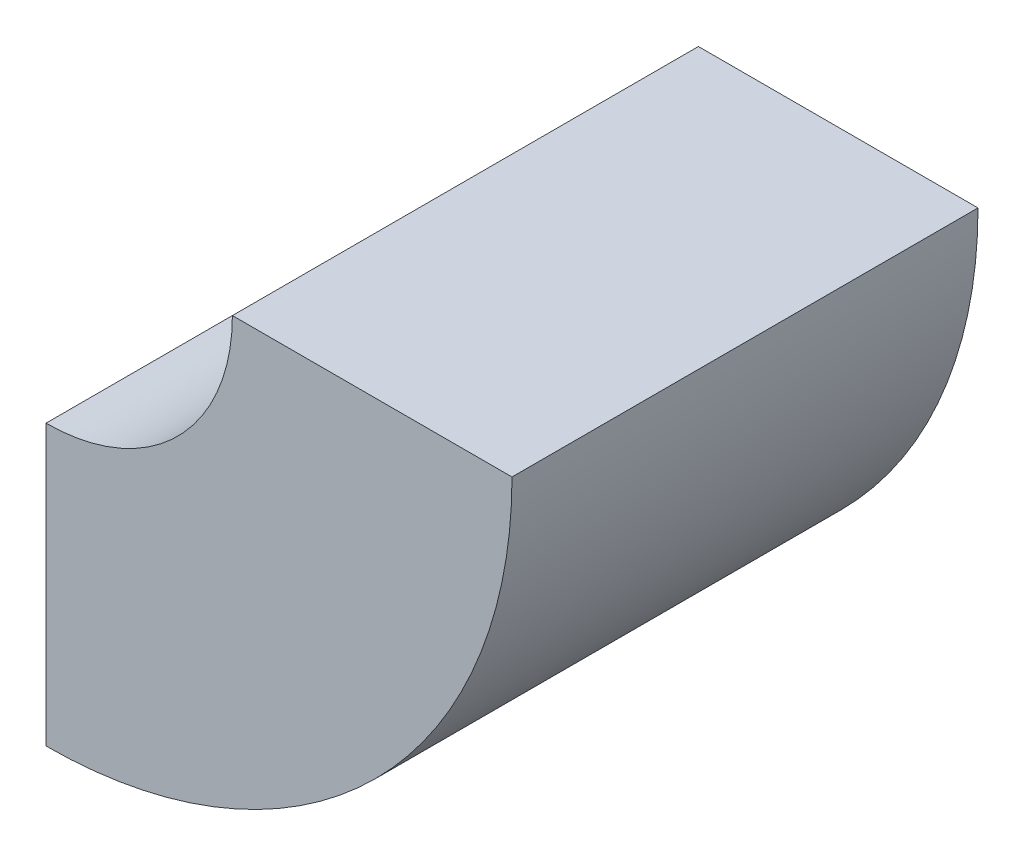
ISO-10303-21;
HEADER;
FILE_DESCRIPTION(('STEP AP214'),'2;1');
FILE_NAME('part.step','',(''),(''),'','','');
FILE_SCHEMA(('AUTOMOTIVE_DESIGN { 1 0 10303 214 1 1 1 1 }'));
ENDSEC;
DATA;
#1=APPLICATION_CONTEXT('core data for automotive mechanical design processes');
#2=APPLICATION_PROTOCOL_DEFINITION('international standard','automotive_design',2000,#1);
#3=PRODUCT_CONTEXT('',#1,'mechanical');
#4=PRODUCT('Part','Part','',(#3));
#5=PRODUCT_RELATED_PRODUCT_CATEGORY('part','',(#4));
#6=PRODUCT_DEFINITION_FORMATION('','',#4);
#7=PRODUCT_DEFINITION_CONTEXT('part definition',#1,'design');
#8=PRODUCT_DEFINITION('design','',#6,#7);
#9=PRODUCT_DEFINITION_SHAPE('','',#8);
#10=(LENGTH_UNIT() NAMED_UNIT(*) SI_UNIT(.MILLI.,.METRE.));
#11=(NAMED_UNIT(*) PLANE_ANGLE_UNIT() SI_UNIT($,.RADIAN.));
#12=(NAMED_UNIT(*) SI_UNIT($,.STERADIAN.) SOLID_ANGLE_UNIT());
#13=UNCERTAINTY_MEASURE_WITH_UNIT(LENGTH_MEASURE(1.E-05),#10,'distance_accuracy_value','');
#14=(GEOMETRIC_REPRESENTATION_CONTEXT(3) GLOBAL_UNCERTAINTY_ASSIGNED_CONTEXT((#13)) GLOBAL_UNIT_ASSIGNED_CONTEXT((#10,
#11,#12)) REPRESENTATION_CONTEXT('',''));
#15=CARTESIAN_POINT('',(0.,0.,0.));
#16=DIRECTION('',(0.,0.,1.));
#17=DIRECTION('',(1.,0.,0.));
#18=AXIS2_PLACEMENT_3D('',#15,#16,#17);
#19=CARTESIAN_POINT('',(-25.,0.,25.));
#20=DIRECTION('',(0.,0.,-1.));
#21=DIRECTION('',(-1.,0.,0.));
#22=AXIS2_PLACEMENT_3D('',#19,#20,#21);
#23=CYLINDRICAL_SURFACE('',#22,10.);
#24=CARTESIAN_POINT('',(-25.,0.,0.));
#25=DIRECTION('',(0.,0.,-1.));
#26=DIRECTION('',(1.,0.,0.));
#27=AXIS2_PLACEMENT_3D('',#24,#25,#26);
#28=CIRCLE('',#27,10.);
#29=CARTESIAN_POINT('',(-15.,0.,0.));
#30=VERTEX_POINT('',#29);
#31=CARTESIAN_POINT('',(-25.,-9.99999999999999,0.));
#32=VERTEX_POINT('',#31);
#33=EDGE_CURVE('E96',#30,#32,#28,.T.);
#34=ORIENTED_EDGE('',*,*,#33,.T.);
#35=DIRECTION('',(0.,0.,-1.));
#36=VECTOR('',#35,1.);
#37=CARTESIAN_POINT('',(-25.,-9.99999999999999,25.));
#38=LINE('',#37,#36);
#39=CARTESIAN_POINT('',(-25.,-9.99999999999999,25.));
#40=VERTEX_POINT('',#39);
#41=EDGE_CURVE('E11',#40,#32,#38,.T.);
#42=ORIENTED_EDGE('',*,*,#41,.F.);
#43=CARTESIAN_POINT('',(-25.,0.,25.));
#44=DIRECTION('',(0.,0.,-1.));
#45=DIRECTION('',(1.,0.,0.));
#46=AXIS2_PLACEMENT_3D('',#43,#44,#45);
#47=CIRCLE('',#46,10.);
#48=CARTESIAN_POINT('',(-15.,0.,25.));
#49=VERTEX_POINT('',#48);
#50=EDGE_CURVE('E84',#49,#40,#47,.T.);
#51=ORIENTED_EDGE('',*,*,#50,.F.);
#52=DIRECTION('',(0.,0.,-1.));
#53=VECTOR('',#52,1.);
#54=CARTESIAN_POINT('',(-15.,0.,25.));
#55=LINE('',#54,#53);
#56=EDGE_CURVE('E92',#49,#30,#55,.T.);
#57=ORIENTED_EDGE('',*,*,#56,.T.);
#58=EDGE_LOOP('',(#34,#42,#51,#57));
#59=FACE_BOUND('',#58,.T.);
#60=ADVANCED_FACE('F33',(#59),#23,.F.);
#61=CARTESIAN_POINT('',(-25.,-9.99999999999999,25.));
#62=DIRECTION('',(1.,0.,0.));
#63=DIRECTION('',(0.,0.,-1.));
#64=AXIS2_PLACEMENT_3D('',#61,#62,#63);
#65=PLANE('',#64);
#66=DIRECTION('',(0.,-1.,0.));
#67=VECTOR('',#66,1.);
#68=CARTESIAN_POINT('',(-25.,-9.99999999999999,0.));
#69=LINE('',#68,#67);
#70=CARTESIAN_POINT('',(-25.,-25.,0.));
#71=VERTEX_POINT('',#70);
#72=EDGE_CURVE('E88',#32,#71,#69,.T.);
#73=ORIENTED_EDGE('',*,*,#72,.T.);
#74=DIRECTION('',(0.,0.,-1.));
#75=VECTOR('',#74,1.);
#76=CARTESIAN_POINT('',(-25.,-25.,25.));
#77=LINE('',#76,#75);
#78=CARTESIAN_POINT('',(-25.,-25.,25.));
#79=VERTEX_POINT('',#78);
#80=EDGE_CURVE('E41',#79,#71,#77,.T.);
#81=ORIENTED_EDGE('',*,*,#80,.F.);
#82=DIRECTION('',(0.,-1.,0.));
#83=VECTOR('',#82,1.);
#84=CARTESIAN_POINT('',(-25.,-9.99999999999999,25.));
#85=LINE('',#84,#83);
#86=EDGE_CURVE('E79',#40,#79,#85,.T.);
#87=ORIENTED_EDGE('',*,*,#86,.F.);
#88=ORIENTED_EDGE('',*,*,#41,.T.);
#89=EDGE_LOOP('',(#73,#81,#87,#88));
#90=FACE_BOUND('',#89,.T.);
#91=ADVANCED_FACE('F87',(#90),#65,.F.);
#92=CARTESIAN_POINT('',(-25.,0.,25.));
#93=DIRECTION('',(0.,0.,-1.));
#94=DIRECTION('',(-1.,0.,0.));
#95=AXIS2_PLACEMENT_3D('',#92,#93,#94);
#96=CYLINDRICAL_SURFACE('',#95,25.);
#97=CARTESIAN_POINT('',(-25.,0.,0.));
#98=DIRECTION('',(0.,0.,1.));
#99=DIRECTION('',(1.,0.,0.));
#100=AXIS2_PLACEMENT_3D('',#97,#98,#99);
#101=CIRCLE('',#100,25.);
#102=CARTESIAN_POINT('',(0.,0.,0.));
#103=VERTEX_POINT('',#102);
#104=EDGE_CURVE('E66',#71,#103,#101,.T.);
#105=ORIENTED_EDGE('',*,*,#104,.T.);
#106=DIRECTION('',(0.,0.,-1.));
#107=VECTOR('',#106,1.);
#108=CARTESIAN_POINT('',(0.,0.,25.));
#109=LINE('',#108,#107);
#110=CARTESIAN_POINT('',(0.,0.,25.));
#111=VERTEX_POINT('',#110);
#112=EDGE_CURVE('E89',#111,#103,#109,.T.);
#113=ORIENTED_EDGE('',*,*,#112,.F.);
#114=CARTESIAN_POINT('',(-25.,0.,25.));
#115=DIRECTION('',(0.,0.,1.));
#116=DIRECTION('',(1.,0.,0.));
#117=AXIS2_PLACEMENT_3D('',#114,#115,#116);
#118=CIRCLE('',#117,25.);
#119=EDGE_CURVE('E82',#79,#111,#118,.T.);
#120=ORIENTED_EDGE('',*,*,#119,.F.);
#121=ORIENTED_EDGE('',*,*,#80,.T.);
#122=EDGE_LOOP('',(#105,#113,#120,#121));
#123=FACE_BOUND('',#122,.T.);
#124=ADVANCED_FACE('F90',(#123),#96,.T.);
#125=CARTESIAN_POINT('',(-15.,0.,25.));
#126=DIRECTION('',(0.,-1.,0.));
#127=DIRECTION('',(0.,0.,-1.));
#128=AXIS2_PLACEMENT_3D('',#125,#126,#127);
#129=PLANE('',#128);
#130=DIRECTION('',(-1.,0.,0.));
#131=VECTOR('',#130,1.);
#132=CARTESIAN_POINT('',(-15.,0.,0.));
#133=LINE('',#132,#131);
#134=EDGE_CURVE('E72',#103,#30,#133,.T.);
#135=ORIENTED_EDGE('',*,*,#134,.T.);
#136=ORIENTED_EDGE('',*,*,#56,.F.);
#137=DIRECTION('',(-1.,0.,0.));
#138=VECTOR('',#137,1.);
#139=CARTESIAN_POINT('',(-15.,0.,25.));
#140=LINE('',#139,#138);
#141=EDGE_CURVE('E49',#111,#49,#140,.T.);
#142=ORIENTED_EDGE('',*,*,#141,.F.);
#143=ORIENTED_EDGE('',*,*,#112,.T.);
#144=EDGE_LOOP('',(#135,#136,#142,#143));
#145=FACE_BOUND('',#144,.T.);
#146=ADVANCED_FACE('F103',(#145),#129,.F.);
#147=CARTESIAN_POINT('',(-25.,0.,25.));
#148=DIRECTION('',(0.,0.,1.));
#149=DIRECTION('',(1.,0.,0.));
#150=AXIS2_PLACEMENT_3D('',#147,#148,#149);
#151=PLANE('',#150);
#152=ORIENTED_EDGE('',*,*,#50,.T.);
#153=ORIENTED_EDGE('',*,*,#86,.T.);
#154=ORIENTED_EDGE('',*,*,#119,.T.);
#155=ORIENTED_EDGE('',*,*,#141,.T.);
#156=EDGE_LOOP('',(#152,#153,#154,#155));
#157=FACE_BOUND('',#156,.T.);
#158=ADVANCED_FACE('F80',(#157),#151,.T.);
#159=CARTESIAN_POINT('',(-25.,0.,0.));
#160=DIRECTION('',(0.,0.,1.));
#161=DIRECTION('',(1.,0.,0.));
#162=AXIS2_PLACEMENT_3D('',#159,#160,#161);
#163=PLANE('',#162);
#164=ORIENTED_EDGE('',*,*,#33,.F.);
#165=ORIENTED_EDGE('',*,*,#134,.F.);
#166=ORIENTED_EDGE('',*,*,#104,.F.);
#167=ORIENTED_EDGE('',*,*,#72,.F.);
#168=EDGE_LOOP('',(#164,#165,#166,#167));
#169=FACE_BOUND('',#168,.T.);
#170=ADVANCED_FACE('F106',(#169),#163,.F.);
#171=CLOSED_SHELL('',(#60,#91,#124,#146,#158,#170));
#172=MANIFOLD_SOLID_BREP('B2',#171);
#173=ADVANCED_BREP_SHAPE_REPRESENTATION('',(#18,#172),#14);
#174=SHAPE_DEFINITION_REPRESENTATION(#9,#173);
ENDSEC;
END-ISO-10303-21;
